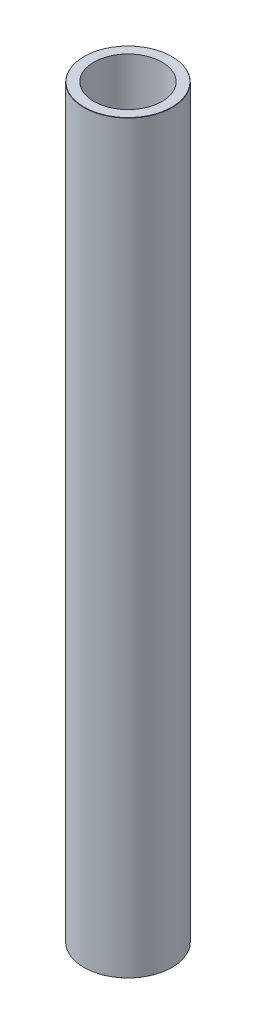
ISO-10303-21;
HEADER;
FILE_DESCRIPTION(('STEP AP214'),'2;1');
FILE_NAME('part.step','',(''),(''),'','','');
FILE_SCHEMA(('AUTOMOTIVE_DESIGN { 1 0 10303 214 1 1 1 1 }'));
ENDSEC;
DATA;
#1=APPLICATION_CONTEXT('core data for automotive mechanical design processes');
#2=APPLICATION_PROTOCOL_DEFINITION('international standard','automotive_design',2000,#1);
#3=PRODUCT_CONTEXT('',#1,'mechanical');
#4=PRODUCT('Part','Part','',(#3));
#5=PRODUCT_RELATED_PRODUCT_CATEGORY('part','',(#4));
#6=PRODUCT_DEFINITION_FORMATION('','',#4);
#7=PRODUCT_DEFINITION_CONTEXT('part definition',#1,'design');
#8=PRODUCT_DEFINITION('design','',#6,#7);
#9=PRODUCT_DEFINITION_SHAPE('','',#8);
#10=(LENGTH_UNIT() NAMED_UNIT(*) SI_UNIT(.MILLI.,.METRE.));
#11=(NAMED_UNIT(*) PLANE_ANGLE_UNIT() SI_UNIT($,.RADIAN.));
#12=(NAMED_UNIT(*) SI_UNIT($,.STERADIAN.) SOLID_ANGLE_UNIT());
#13=UNCERTAINTY_MEASURE_WITH_UNIT(LENGTH_MEASURE(1.E-05),#10,'distance_accuracy_value','');
#14=(GEOMETRIC_REPRESENTATION_CONTEXT(3) GLOBAL_UNCERTAINTY_ASSIGNED_CONTEXT((#13)) GLOBAL_UNIT_ASSIGNED_CONTEXT((#10,
#11,#12)) REPRESENTATION_CONTEXT('',''));
#15=CARTESIAN_POINT('',(0.,0.,0.));
#16=DIRECTION('',(0.,0.,1.));
#17=DIRECTION('',(1.,0.,0.));
#18=AXIS2_PLACEMENT_3D('',#15,#16,#17);
#19=CARTESIAN_POINT('',(0.,549.260506720038,0.));
#20=DIRECTION('',(0.,-1.,0.));
#21=DIRECTION('',(0.,0.,-1.));
#22=AXIS2_PLACEMENT_3D('',#19,#20,#21);
#23=CYLINDRICAL_SURFACE('',#22,32.5);
#24=CARTESIAN_POINT('',(0.,549.042615674749,0.));
#25=DIRECTION('',(0.,1.,0.));
#26=DIRECTION('',(0.,0.,1.));
#27=AXIS2_PLACEMENT_3D('',#24,#25,#26);
#28=CIRCLE('',#27,32.5);
#29=CARTESIAN_POINT('',(0.,549.042615674749,32.5));
#30=VERTEX_POINT('',#29);
#31=EDGE_CURVE('E50',#30,#30,#28,.F.);
#32=ORIENTED_EDGE('',*,*,#31,.T.);
#33=EDGE_LOOP('',(#32));
#34=FACE_BOUND('',#33,.T.);
#35=CARTESIAN_POINT('',(0.,0.18341902633956,0.));
#36=DIRECTION('',(0.,1.,0.));
#37=DIRECTION('',(0.,0.,1.));
#38=AXIS2_PLACEMENT_3D('',#35,#36,#37);
#39=CIRCLE('',#38,32.5);
#40=CARTESIAN_POINT('',(0.,0.18341902633956,32.5));
#41=VERTEX_POINT('',#40);
#42=EDGE_CURVE('E51',#41,#41,#39,.T.);
#43=ORIENTED_EDGE('',*,*,#42,.T.);
#44=EDGE_LOOP('',(#43));
#45=FACE_BOUND('',#44,.T.);
#46=ADVANCED_FACE('F39',(#34,#45),#23,.T.);
#47=CARTESIAN_POINT('',(0.,549.260506720038,0.));
#48=DIRECTION('',(0.,1.,0.));
#49=DIRECTION('',(0.,0.,1.));
#50=AXIS2_PLACEMENT_3D('',#47,#48,#49);
#51=PLANE('',#50);
#52=CARTESIAN_POINT('',(0.,549.260506720038,0.));
#53=DIRECTION('',(0.,1.,0.));
#54=DIRECTION('',(0.,0.,1.));
#55=AXIS2_PLACEMENT_3D('',#52,#53,#54);
#56=CIRCLE('',#55,32.3165809736602);
#57=CARTESIAN_POINT('',(0.,549.260506720038,32.3165809736602));
#58=VERTEX_POINT('',#57);
#59=EDGE_CURVE('E54',#58,#58,#56,.T.);
#60=ORIENTED_EDGE('',*,*,#59,.T.);
#61=EDGE_LOOP('',(#60));
#62=FACE_BOUND('',#61,.T.);
#63=CARTESIAN_POINT('',(0.,549.260506720038,0.));
#64=DIRECTION('',(0.,1.,0.));
#65=DIRECTION('',(0.,0.,1.));
#66=AXIS2_PLACEMENT_3D('',#63,#64,#65);
#67=CIRCLE('',#66,25.1273170109367);
#68=CARTESIAN_POINT('',(0.,549.260506720038,25.1273170109367));
#69=VERTEX_POINT('',#68);
#70=EDGE_CURVE('E58',#69,#69,#67,.T.);
#71=ORIENTED_EDGE('',*,*,#70,.F.);
#72=EDGE_LOOP('',(#71));
#73=FACE_BOUND('',#72,.T.);
#74=ADVANCED_FACE('F69',(#62,#73),#51,.T.);
#75=CARTESIAN_POINT('',(0.,0.,0.));
#76=DIRECTION('',(0.,1.,0.));
#77=DIRECTION('',(0.,0.,1.));
#78=AXIS2_PLACEMENT_3D('',#75,#76,#77);
#79=PLANE('',#78);
#80=CARTESIAN_POINT('',(0.,0.,0.));
#81=DIRECTION('',(0.,1.,0.));
#82=DIRECTION('',(0.,0.,1.));
#83=AXIS2_PLACEMENT_3D('',#80,#81,#82);
#84=CIRCLE('',#83,32.2821089547118);
#85=CARTESIAN_POINT('',(0.,0.,32.2821089547118));
#86=VERTEX_POINT('',#85);
#87=EDGE_CURVE('E10',#86,#86,#84,.F.);
#88=ORIENTED_EDGE('',*,*,#87,.T.);
#89=EDGE_LOOP('',(#88));
#90=FACE_BOUND('',#89,.T.);
#91=CARTESIAN_POINT('',(0.,0.,0.));
#92=DIRECTION('',(0.,1.,0.));
#93=DIRECTION('',(0.,0.,1.));
#94=AXIS2_PLACEMENT_3D('',#91,#92,#93);
#95=CIRCLE('',#94,25.1273170109367);
#96=CARTESIAN_POINT('',(0.,0.,25.1273170109367));
#97=VERTEX_POINT('',#96);
#98=EDGE_CURVE('E63',#97,#97,#95,.T.);
#99=ORIENTED_EDGE('',*,*,#98,.T.);
#100=EDGE_LOOP('',(#99));
#101=FACE_BOUND('',#100,.T.);
#102=ADVANCED_FACE('F75',(#90,#101),#79,.F.);
#103=CARTESIAN_POINT('',(0.,549.260506720038,0.));
#104=DIRECTION('',(0.,-1.,0.));
#105=DIRECTION('',(0.,0.,-1.));
#106=AXIS2_PLACEMENT_3D('',#103,#104,#105);
#107=CYLINDRICAL_SURFACE('',#106,25.1273170109367);
#108=ORIENTED_EDGE('',*,*,#70,.T.);
#109=EDGE_LOOP('',(#108));
#110=FACE_BOUND('',#109,.T.);
#111=ORIENTED_EDGE('',*,*,#98,.F.);
#112=EDGE_LOOP('',(#111));
#113=FACE_BOUND('',#112,.T.);
#114=ADVANCED_FACE('F70',(#110,#113),#107,.F.);
#115=CARTESIAN_POINT('',(0.,549.260506720038,0.));
#116=DIRECTION('',(0.,-1.,0.));
#117=DIRECTION('',(0.,0.,-1.));
#118=AXIS2_PLACEMENT_3D('',#115,#116,#117);
#119=CONICAL_SURFACE('',#118,32.3165809736602,0.699709789704923);
#120=ORIENTED_EDGE('',*,*,#31,.F.);
#121=EDGE_LOOP('',(#120));
#122=FACE_BOUND('',#121,.T.);
#123=ORIENTED_EDGE('',*,*,#59,.F.);
#124=EDGE_LOOP('',(#123));
#125=FACE_BOUND('',#124,.T.);
#126=ADVANCED_FACE('F81',(#122,#125),#119,.T.);
#127=CARTESIAN_POINT('',(0.,0.18341902633956,0.));
#128=DIRECTION('',(0.,1.,0.));
#129=DIRECTION('',(0.,0.,1.));
#130=AXIS2_PLACEMENT_3D('',#127,#128,#129);
#131=CONICAL_SURFACE('',#130,32.5,0.871086537089931);
#132=ORIENTED_EDGE('',*,*,#87,.F.);
#133=EDGE_LOOP('',(#132));
#134=FACE_BOUND('',#133,.T.);
#135=ORIENTED_EDGE('',*,*,#42,.F.);
#136=EDGE_LOOP('',(#135));
#137=FACE_BOUND('',#136,.T.);
#138=ADVANCED_FACE('F45',(#134,#137),#131,.T.);
#139=CLOSED_SHELL('',(#46,#74,#102,#114,#126,#138));
#140=MANIFOLD_SOLID_BREP('B2',#139);
#141=ADVANCED_BREP_SHAPE_REPRESENTATION('',(#18,#140),#14);
#142=SHAPE_DEFINITION_REPRESENTATION(#9,#141);
ENDSEC;
END-ISO-10303-21;
